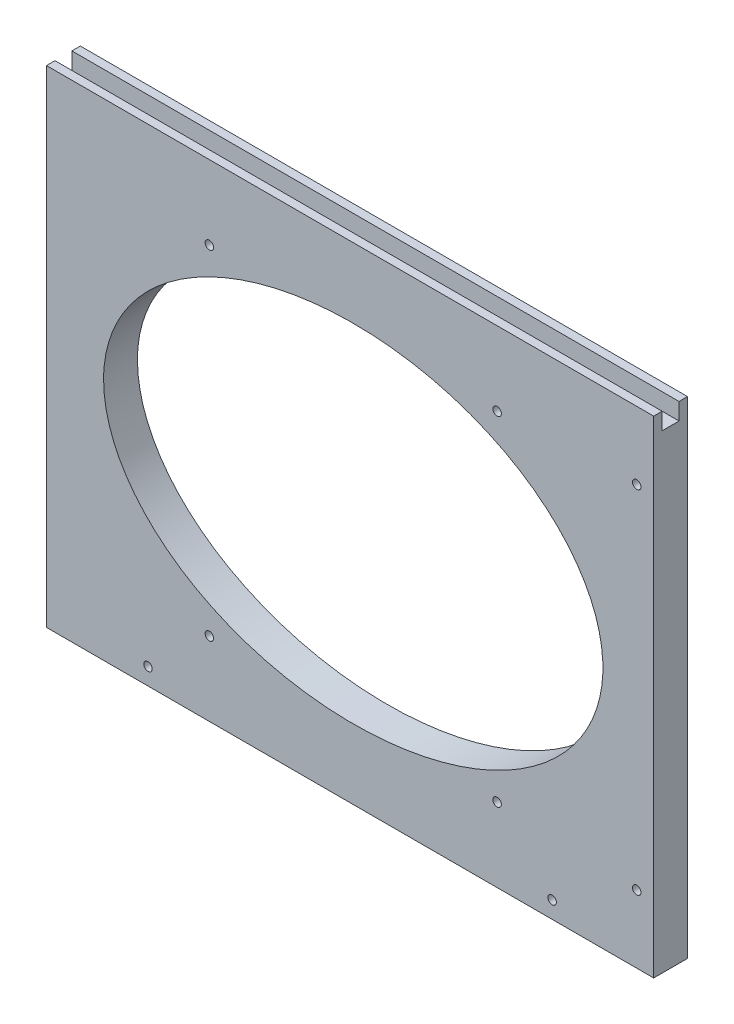
ISO-10303-21;
HEADER;
FILE_DESCRIPTION(('STEP AP214'),'2;1');
FILE_NAME('part.step','',(''),(''),'','','');
FILE_SCHEMA(('AUTOMOTIVE_DESIGN { 1 0 10303 214 1 1 1 1 }'));
ENDSEC;
DATA;
#1=APPLICATION_CONTEXT('core data for automotive mechanical design processes');
#2=APPLICATION_PROTOCOL_DEFINITION('international standard','automotive_design',2000,#1);
#3=PRODUCT_CONTEXT('',#1,'mechanical');
#4=PRODUCT('Part','Part','',(#3));
#5=PRODUCT_RELATED_PRODUCT_CATEGORY('part','',(#4));
#6=PRODUCT_DEFINITION_FORMATION('','',#4);
#7=PRODUCT_DEFINITION_CONTEXT('part definition',#1,'design');
#8=PRODUCT_DEFINITION('design','',#6,#7);
#9=PRODUCT_DEFINITION_SHAPE('','',#8);
#10=(LENGTH_UNIT() NAMED_UNIT(*) SI_UNIT(.MILLI.,.METRE.));
#11=(NAMED_UNIT(*) PLANE_ANGLE_UNIT() SI_UNIT($,.RADIAN.));
#12=(NAMED_UNIT(*) SI_UNIT($,.STERADIAN.) SOLID_ANGLE_UNIT());
#13=UNCERTAINTY_MEASURE_WITH_UNIT(LENGTH_MEASURE(1.E-05),#10,'distance_accuracy_value','');
#14=(GEOMETRIC_REPRESENTATION_CONTEXT(3) GLOBAL_UNCERTAINTY_ASSIGNED_CONTEXT((#13)) GLOBAL_UNIT_ASSIGNED_CONTEXT((#10,
#11,#12)) REPRESENTATION_CONTEXT('',''));
#15=CARTESIAN_POINT('',(0.,0.,0.));
#16=DIRECTION('',(0.,0.,1.));
#17=DIRECTION('',(1.,0.,0.));
#18=AXIS2_PLACEMENT_3D('',#15,#16,#17);
#19=CARTESIAN_POINT('',(-5512.59375,1181.1,-12.7));
#20=DIRECTION('',(0.,1.,0.));
#21=DIRECTION('',(0.,0.,1.));
#22=AXIS2_PLACEMENT_3D('',#19,#20,#21);
#23=PLANE('',#22);
#24=DIRECTION('',(1.,0.,0.));
#25=VECTOR('',#24,1.);
#26=CARTESIAN_POINT('',(-5749.38025612107,1181.1,-3.175));
#27=LINE('',#26,#25);
#28=CARTESIAN_POINT('',(-5740.4,1181.1,-3.175));
#29=VERTEX_POINT('',#28);
#30=CARTESIAN_POINT('',(-5512.59375,1181.1,-3.175));
#31=VERTEX_POINT('',#30);
#32=EDGE_CURVE('E109',#29,#31,#27,.T.);
#33=ORIENTED_EDGE('',*,*,#32,.F.);
#34=DIRECTION('',(0.,0.,1.));
#35=VECTOR('',#34,1.);
#36=CARTESIAN_POINT('',(-5740.4,1181.1,-12.7));
#37=LINE('',#36,#35);
#38=CARTESIAN_POINT('',(-5740.4,1181.1,0.));
#39=VERTEX_POINT('',#38);
#40=EDGE_CURVE('E118',#29,#39,#37,.T.);
#41=ORIENTED_EDGE('',*,*,#40,.T.);
#42=DIRECTION('',(-1.,0.,0.));
#43=VECTOR('',#42,1.);
#44=CARTESIAN_POINT('',(-5512.59375,1181.1,0.));
#45=LINE('',#44,#43);
#46=CARTESIAN_POINT('',(-5512.59375,1181.1,0.));
#47=VERTEX_POINT('',#46);
#48=EDGE_CURVE('E132',#47,#39,#45,.T.);
#49=ORIENTED_EDGE('',*,*,#48,.F.);
#50=DIRECTION('',(0.,0.,1.));
#51=VECTOR('',#50,1.);
#52=CARTESIAN_POINT('',(-5512.59375,1181.1,-12.7));
#53=LINE('',#52,#51);
#54=EDGE_CURVE('E120',#31,#47,#53,.T.);
#55=ORIENTED_EDGE('',*,*,#54,.F.);
#56=EDGE_LOOP('',(#33,#41,#49,#55));
#57=FACE_BOUND('',#56,.T.);
#58=ADVANCED_FACE('F31',(#57),#23,.T.);
#59=CARTESIAN_POINT('',(-5740.4,998.5375,-12.7));
#60=DIRECTION('',(0.,-1.,0.));
#61=DIRECTION('',(0.,0.,-1.));
#62=AXIS2_PLACEMENT_3D('',#59,#60,#61);
#63=PLANE('',#62);
#64=DIRECTION('',(1.,0.,0.));
#65=VECTOR('',#64,1.);
#66=CARTESIAN_POINT('',(-5740.4,998.5375,0.));
#67=LINE('',#66,#65);
#68=CARTESIAN_POINT('',(-5740.4,998.5375,0.));
#69=VERTEX_POINT('',#68);
#70=CARTESIAN_POINT('',(-5512.59375,998.5375,0.));
#71=VERTEX_POINT('',#70);
#72=EDGE_CURVE('E137',#69,#71,#67,.T.);
#73=ORIENTED_EDGE('',*,*,#72,.F.);
#74=DIRECTION('',(0.,0.,1.));
#75=VECTOR('',#74,1.);
#76=CARTESIAN_POINT('',(-5740.4,998.5375,-12.7));
#77=LINE('',#76,#75);
#78=CARTESIAN_POINT('',(-5740.4,998.5375,-12.7));
#79=VERTEX_POINT('',#78);
#80=EDGE_CURVE('E11',#79,#69,#77,.T.);
#81=ORIENTED_EDGE('',*,*,#80,.F.);
#82=DIRECTION('',(1.,0.,0.));
#83=VECTOR('',#82,1.);
#84=CARTESIAN_POINT('',(-5740.4,998.5375,-12.7));
#85=LINE('',#84,#83);
#86=CARTESIAN_POINT('',(-5512.59375,998.5375,-12.7));
#87=VERTEX_POINT('',#86);
#88=EDGE_CURVE('E131',#79,#87,#85,.T.);
#89=ORIENTED_EDGE('',*,*,#88,.T.);
#90=DIRECTION('',(0.,0.,1.));
#91=VECTOR('',#90,1.);
#92=CARTESIAN_POINT('',(-5512.59375,998.5375,-12.7));
#93=LINE('',#92,#91);
#94=EDGE_CURVE('E35',#87,#71,#93,.T.);
#95=ORIENTED_EDGE('',*,*,#94,.T.);
#96=EDGE_LOOP('',(#73,#81,#89,#95));
#97=FACE_BOUND('',#96,.T.);
#98=ADVANCED_FACE('F33',(#97),#63,.T.);
#99=CARTESIAN_POINT('',(-5740.4,1181.1,-12.7));
#100=DIRECTION('',(-1.,0.,0.));
#101=DIRECTION('',(0.,0.,1.));
#102=AXIS2_PLACEMENT_3D('',#99,#100,#101);
#103=PLANE('',#102);
#104=DIRECTION('',(0.,-1.,0.));
#105=VECTOR('',#104,1.);
#106=CARTESIAN_POINT('',(-5740.4,1181.1,-3.175));
#107=LINE('',#106,#105);
#108=CARTESIAN_POINT('',(-5740.4,1174.75,-3.175));
#109=VERTEX_POINT('',#108);
#110=EDGE_CURVE('E105',#29,#109,#107,.T.);
#111=ORIENTED_EDGE('',*,*,#110,.T.);
#112=DIRECTION('',(0.,0.,-1.));
#113=VECTOR('',#112,1.);
#114=CARTESIAN_POINT('',(-5740.4,1174.75,-3.175));
#115=LINE('',#114,#113);
#116=CARTESIAN_POINT('',(-5740.4,1174.75,-9.525));
#117=VERTEX_POINT('',#116);
#118=EDGE_CURVE('E202',#109,#117,#115,.T.);
#119=ORIENTED_EDGE('',*,*,#118,.T.);
#120=DIRECTION('',(0.,1.,0.));
#121=VECTOR('',#120,1.);
#122=CARTESIAN_POINT('',(-5740.4,1174.75,-9.525));
#123=LINE('',#122,#121);
#124=CARTESIAN_POINT('',(-5740.4,1181.1,-9.525));
#125=VERTEX_POINT('',#124);
#126=EDGE_CURVE('E197',#117,#125,#123,.T.);
#127=ORIENTED_EDGE('',*,*,#126,.T.);
#128=CARTESIAN_POINT('',(-5740.4,1181.1,-12.7));
#129=VERTEX_POINT('',#128);
#130=EDGE_CURVE('E40',#129,#125,#37,.T.);
#131=ORIENTED_EDGE('',*,*,#130,.F.);
#132=DIRECTION('',(0.,-1.,0.));
#133=VECTOR('',#132,1.);
#134=CARTESIAN_POINT('',(-5740.4,1181.1,-12.7));
#135=LINE('',#134,#133);
#136=EDGE_CURVE('E141',#129,#79,#135,.T.);
#137=ORIENTED_EDGE('',*,*,#136,.T.);
#138=ORIENTED_EDGE('',*,*,#80,.T.);
#139=DIRECTION('',(0.,-1.,0.));
#140=VECTOR('',#139,1.);
#141=CARTESIAN_POINT('',(-5740.4,1181.1,0.));
#142=LINE('',#141,#140);
#143=EDGE_CURVE('E124',#39,#69,#142,.T.);
#144=ORIENTED_EDGE('',*,*,#143,.F.);
#145=ORIENTED_EDGE('',*,*,#40,.F.);
#146=EDGE_LOOP('',(#111,#119,#127,#131,#137,#138,#144,#145));
#147=FACE_BOUND('',#146,.T.);
#148=ADVANCED_FACE('F122',(#147),#103,.T.);
#149=DIRECTION('',(1.,0.,0.));
#150=VECTOR('',#149,1.);
#151=CARTESIAN_POINT('',(-5749.38025612107,1181.1,-9.525));
#152=LINE('',#151,#150);
#153=CARTESIAN_POINT('',(-5512.59375,1181.1,-9.525));
#154=VERTEX_POINT('',#153);
#155=EDGE_CURVE('E200',#125,#154,#152,.T.);
#156=ORIENTED_EDGE('',*,*,#155,.T.);
#157=CARTESIAN_POINT('',(-5512.59375,1181.1,-12.7));
#158=VERTEX_POINT('',#157);
#159=EDGE_CURVE('E125',#158,#154,#53,.T.);
#160=ORIENTED_EDGE('',*,*,#159,.F.);
#161=DIRECTION('',(-1.,0.,0.));
#162=VECTOR('',#161,1.);
#163=CARTESIAN_POINT('',(-5512.59375,1181.1,-12.7));
#164=LINE('',#163,#162);
#165=EDGE_CURVE('E143',#158,#129,#164,.T.);
#166=ORIENTED_EDGE('',*,*,#165,.T.);
#167=ORIENTED_EDGE('',*,*,#130,.T.);
#168=EDGE_LOOP('',(#156,#160,#166,#167));
#169=FACE_BOUND('',#168,.T.);
#170=ADVANCED_FACE('F177',(#169),#23,.T.);
#171=CARTESIAN_POINT('',(-5512.59375,998.5375,-12.7));
#172=DIRECTION('',(1.,0.,0.));
#173=DIRECTION('',(0.,0.,-1.));
#174=AXIS2_PLACEMENT_3D('',#171,#172,#173);
#175=PLANE('',#174);
#176=DIRECTION('',(0.,-1.,0.));
#177=VECTOR('',#176,1.);
#178=CARTESIAN_POINT('',(-5512.59375,1181.1,-3.175));
#179=LINE('',#178,#177);
#180=CARTESIAN_POINT('',(-5512.59375,1174.75,-3.175));
#181=VERTEX_POINT('',#180);
#182=EDGE_CURVE('E190',#31,#181,#179,.T.);
#183=ORIENTED_EDGE('',*,*,#182,.F.);
#184=ORIENTED_EDGE('',*,*,#54,.T.);
#185=DIRECTION('',(0.,1.,0.));
#186=VECTOR('',#185,1.);
#187=CARTESIAN_POINT('',(-5512.59375,998.5375,0.));
#188=LINE('',#187,#186);
#189=EDGE_CURVE('E134',#71,#47,#188,.T.);
#190=ORIENTED_EDGE('',*,*,#189,.F.);
#191=ORIENTED_EDGE('',*,*,#94,.F.);
#192=DIRECTION('',(0.,1.,0.));
#193=VECTOR('',#192,1.);
#194=CARTESIAN_POINT('',(-5512.59375,998.5375,-12.7));
#195=LINE('',#194,#193);
#196=EDGE_CURVE('E146',#87,#158,#195,.T.);
#197=ORIENTED_EDGE('',*,*,#196,.T.);
#198=ORIENTED_EDGE('',*,*,#159,.T.);
#199=DIRECTION('',(0.,1.,0.));
#200=VECTOR('',#199,1.);
#201=CARTESIAN_POINT('',(-5512.59375,1174.75,-9.525));
#202=LINE('',#201,#200);
#203=CARTESIAN_POINT('',(-5512.59375,1174.75,-9.525));
#204=VERTEX_POINT('',#203);
#205=EDGE_CURVE('E192',#204,#154,#202,.T.);
#206=ORIENTED_EDGE('',*,*,#205,.F.);
#207=DIRECTION('',(0.,0.,-1.));
#208=VECTOR('',#207,1.);
#209=CARTESIAN_POINT('',(-5512.59375,1174.75,-3.175));
#210=LINE('',#209,#208);
#211=EDGE_CURVE('E48',#181,#204,#210,.T.);
#212=ORIENTED_EDGE('',*,*,#211,.F.);
#213=EDGE_LOOP('',(#183,#184,#190,#191,#197,#198,#206,#212));
#214=FACE_BOUND('',#213,.T.);
#215=ADVANCED_FACE('F170',(#214),#175,.T.);
#216=CARTESIAN_POINT('',(-5512.59375,998.5375,-12.7));
#217=DIRECTION('',(0.,0.,1.));
#218=DIRECTION('',(1.,0.,0.));
#219=AXIS2_PLACEMENT_3D('',#216,#217,#218);
#220=PLANE('',#219);
#221=CARTESIAN_POINT('',(-5679.28125,1153.31875,-12.7));
#222=DIRECTION('',(0.,0.,1.));
#223=DIRECTION('',(1.,0.,0.));
#224=AXIS2_PLACEMENT_3D('',#221,#222,#223);
#225=CIRCLE('',#224,1.58750000000051);
#226=CARTESIAN_POINT('',(-5677.69375,1153.31875,-12.7));
#227=VERTEX_POINT('',#226);
#228=EDGE_CURVE('E211',#227,#227,#225,.F.);
#229=ORIENTED_EDGE('',*,*,#228,.F.);
#230=EDGE_LOOP('',(#229));
#231=FACE_BOUND('',#230,.T.);
#232=CARTESIAN_POINT('',(-5702.3,1004.8875,-12.7));
#233=DIRECTION('',(0.,0.,1.));
#234=DIRECTION('',(1.,0.,0.));
#235=AXIS2_PLACEMENT_3D('',#232,#233,#234);
#236=CIRCLE('',#235,1.58750000000051);
#237=CARTESIAN_POINT('',(-5700.7125,1004.8875,-12.7));
#238=VERTEX_POINT('',#237);
#239=EDGE_CURVE('E217',#238,#238,#236,.F.);
#240=ORIENTED_EDGE('',*,*,#239,.F.);
#241=EDGE_LOOP('',(#240));
#242=FACE_BOUND('',#241,.T.);
#243=CARTESIAN_POINT('',(-5679.28125,1026.31875,-12.7));
#244=DIRECTION('',(0.,0.,1.));
#245=DIRECTION('',(1.,0.,0.));
#246=AXIS2_PLACEMENT_3D('',#243,#244,#245);
#247=CIRCLE('',#246,1.58750000000045);
#248=CARTESIAN_POINT('',(-5677.69375,1026.31875,-12.7));
#249=VERTEX_POINT('',#248);
#250=EDGE_CURVE('E223',#249,#249,#247,.F.);
#251=ORIENTED_EDGE('',*,*,#250,.F.);
#252=EDGE_LOOP('',(#251));
#253=FACE_BOUND('',#252,.T.);
#254=CARTESIAN_POINT('',(-5571.33125,1026.31875,-12.7));
#255=DIRECTION('',(0.,0.,1.));
#256=DIRECTION('',(1.,0.,0.));
#257=AXIS2_PLACEMENT_3D('',#254,#255,#256);
#258=CIRCLE('',#257,1.58750000000045);
#259=CARTESIAN_POINT('',(-5569.74375,1026.31875,-12.7));
#260=VERTEX_POINT('',#259);
#261=EDGE_CURVE('E229',#260,#260,#258,.F.);
#262=ORIENTED_EDGE('',*,*,#261,.F.);
#263=EDGE_LOOP('',(#262));
#264=FACE_BOUND('',#263,.T.);
#265=CARTESIAN_POINT('',(-5550.69375,1004.8875,-12.7));
#266=DIRECTION('',(0.,0.,1.));
#267=DIRECTION('',(1.,0.,0.));
#268=AXIS2_PLACEMENT_3D('',#265,#266,#267);
#269=CIRCLE('',#268,1.58750000000051);
#270=CARTESIAN_POINT('',(-5549.10625,1004.8875,-12.7));
#271=VERTEX_POINT('',#270);
#272=EDGE_CURVE('E235',#271,#271,#269,.F.);
#273=ORIENTED_EDGE('',*,*,#272,.F.);
#274=EDGE_LOOP('',(#273));
#275=FACE_BOUND('',#274,.T.);
#276=CARTESIAN_POINT('',(-5518.94375,1023.9375,-12.7));
#277=DIRECTION('',(0.,0.,1.));
#278=DIRECTION('',(1.,0.,0.));
#279=AXIS2_PLACEMENT_3D('',#276,#277,#278);
#280=CIRCLE('',#279,1.58750000000051);
#281=CARTESIAN_POINT('',(-5517.35625,1023.9375,-12.7));
#282=VERTEX_POINT('',#281);
#283=EDGE_CURVE('E241',#282,#282,#280,.F.);
#284=ORIENTED_EDGE('',*,*,#283,.F.);
#285=EDGE_LOOP('',(#284));
#286=FACE_BOUND('',#285,.T.);
#287=CARTESIAN_POINT('',(-5518.94375,1155.7,-12.7));
#288=DIRECTION('',(0.,0.,1.));
#289=DIRECTION('',(1.,0.,0.));
#290=AXIS2_PLACEMENT_3D('',#287,#288,#289);
#291=CIRCLE('',#290,1.58750000000051);
#292=CARTESIAN_POINT('',(-5517.35625,1155.7,-12.7));
#293=VERTEX_POINT('',#292);
#294=EDGE_CURVE('E247',#293,#293,#291,.F.);
#295=ORIENTED_EDGE('',*,*,#294,.F.);
#296=EDGE_LOOP('',(#295));
#297=FACE_BOUND('',#296,.T.);
#298=CARTESIAN_POINT('',(-5571.33125,1153.31875,-12.7));
#299=DIRECTION('',(0.,0.,1.));
#300=DIRECTION('',(1.,0.,0.));
#301=AXIS2_PLACEMENT_3D('',#298,#299,#300);
#302=CIRCLE('',#301,1.58750000000045);
#303=CARTESIAN_POINT('',(-5569.74375,1153.31875,-12.7));
#304=VERTEX_POINT('',#303);
#305=EDGE_CURVE('E154',#304,#304,#302,.F.);
#306=ORIENTED_EDGE('',*,*,#305,.F.);
#307=EDGE_LOOP('',(#306));
#308=FACE_BOUND('',#307,.T.);
#309=CARTESIAN_POINT('',(-5625.30625,1089.81875,-12.7));
#310=DIRECTION('',(0.,0.,1.));
#311=DIRECTION('',(-1.,0.,0.));
#312=AXIS2_PLACEMENT_3D('',#309,#310,#311);
#313=ELLIPSE('',#312,93.6624999999998,65.0874999965074);
#314=CARTESIAN_POINT('',(-5718.96875,1089.81875,-12.7));
#315=VERTEX_POINT('',#314);
#316=EDGE_CURVE('E140',#315,#315,#313,.F.);
#317=ORIENTED_EDGE('',*,*,#316,.F.);
#318=EDGE_LOOP('',(#317));
#319=FACE_BOUND('',#318,.T.);
#320=ORIENTED_EDGE('',*,*,#88,.F.);
#321=ORIENTED_EDGE('',*,*,#136,.F.);
#322=ORIENTED_EDGE('',*,*,#165,.F.);
#323=ORIENTED_EDGE('',*,*,#196,.F.);
#324=EDGE_LOOP('',(#320,#321,#322,#323));
#325=FACE_BOUND('',#324,.T.);
#326=ADVANCED_FACE('F167',(#231,#242,#253,#264,#275,#286,#297,#308,#319,#325),#220,.F.);
#327=CARTESIAN_POINT('',(-5512.59375,998.5375,0.));
#328=DIRECTION('',(0.,0.,1.));
#329=DIRECTION('',(1.,0.,0.));
#330=AXIS2_PLACEMENT_3D('',#327,#328,#329);
#331=PLANE('',#330);
#332=CARTESIAN_POINT('',(-5679.28125,1153.31875,0.));
#333=DIRECTION('',(0.,0.,1.));
#334=DIRECTION('',(1.,0.,0.));
#335=AXIS2_PLACEMENT_3D('',#332,#333,#334);
#336=CIRCLE('',#335,1.58750000000051);
#337=CARTESIAN_POINT('',(-5677.69375,1153.31875,0.));
#338=VERTEX_POINT('',#337);
#339=EDGE_CURVE('E206',#338,#338,#336,.T.);
#340=ORIENTED_EDGE('',*,*,#339,.F.);
#341=EDGE_LOOP('',(#340));
#342=FACE_BOUND('',#341,.T.);
#343=CARTESIAN_POINT('',(-5702.3,1004.8875,0.));
#344=DIRECTION('',(0.,0.,1.));
#345=DIRECTION('',(1.,0.,0.));
#346=AXIS2_PLACEMENT_3D('',#343,#344,#345);
#347=CIRCLE('',#346,1.58750000000051);
#348=CARTESIAN_POINT('',(-5700.7125,1004.8875,0.));
#349=VERTEX_POINT('',#348);
#350=EDGE_CURVE('E214',#349,#349,#347,.T.);
#351=ORIENTED_EDGE('',*,*,#350,.F.);
#352=EDGE_LOOP('',(#351));
#353=FACE_BOUND('',#352,.T.);
#354=CARTESIAN_POINT('',(-5679.28125,1026.31875,0.));
#355=DIRECTION('',(0.,0.,1.));
#356=DIRECTION('',(1.,0.,0.));
#357=AXIS2_PLACEMENT_3D('',#354,#355,#356);
#358=CIRCLE('',#357,1.58750000000045);
#359=CARTESIAN_POINT('',(-5677.69375,1026.31875,0.));
#360=VERTEX_POINT('',#359);
#361=EDGE_CURVE('E220',#360,#360,#358,.T.);
#362=ORIENTED_EDGE('',*,*,#361,.F.);
#363=EDGE_LOOP('',(#362));
#364=FACE_BOUND('',#363,.T.);
#365=CARTESIAN_POINT('',(-5571.33125,1026.31875,0.));
#366=DIRECTION('',(0.,0.,1.));
#367=DIRECTION('',(1.,0.,0.));
#368=AXIS2_PLACEMENT_3D('',#365,#366,#367);
#369=CIRCLE('',#368,1.58750000000045);
#370=CARTESIAN_POINT('',(-5569.74375,1026.31875,0.));
#371=VERTEX_POINT('',#370);
#372=EDGE_CURVE('E226',#371,#371,#369,.T.);
#373=ORIENTED_EDGE('',*,*,#372,.F.);
#374=EDGE_LOOP('',(#373));
#375=FACE_BOUND('',#374,.T.);
#376=CARTESIAN_POINT('',(-5550.69375,1004.8875,0.));
#377=DIRECTION('',(0.,0.,1.));
#378=DIRECTION('',(1.,0.,0.));
#379=AXIS2_PLACEMENT_3D('',#376,#377,#378);
#380=CIRCLE('',#379,1.58750000000051);
#381=CARTESIAN_POINT('',(-5549.10625,1004.8875,0.));
#382=VERTEX_POINT('',#381);
#383=EDGE_CURVE('E232',#382,#382,#380,.T.);
#384=ORIENTED_EDGE('',*,*,#383,.F.);
#385=EDGE_LOOP('',(#384));
#386=FACE_BOUND('',#385,.T.);
#387=CARTESIAN_POINT('',(-5518.94375,1023.9375,0.));
#388=DIRECTION('',(0.,0.,1.));
#389=DIRECTION('',(1.,0.,0.));
#390=AXIS2_PLACEMENT_3D('',#387,#388,#389);
#391=CIRCLE('',#390,1.58750000000051);
#392=CARTESIAN_POINT('',(-5517.35625,1023.9375,0.));
#393=VERTEX_POINT('',#392);
#394=EDGE_CURVE('E238',#393,#393,#391,.T.);
#395=ORIENTED_EDGE('',*,*,#394,.F.);
#396=EDGE_LOOP('',(#395));
#397=FACE_BOUND('',#396,.T.);
#398=CARTESIAN_POINT('',(-5518.94375,1155.7,0.));
#399=DIRECTION('',(0.,0.,1.));
#400=DIRECTION('',(1.,0.,0.));
#401=AXIS2_PLACEMENT_3D('',#398,#399,#400);
#402=CIRCLE('',#401,1.58750000000051);
#403=CARTESIAN_POINT('',(-5517.35625,1155.7,0.));
#404=VERTEX_POINT('',#403);
#405=EDGE_CURVE('E244',#404,#404,#402,.T.);
#406=ORIENTED_EDGE('',*,*,#405,.F.);
#407=EDGE_LOOP('',(#406));
#408=FACE_BOUND('',#407,.T.);
#409=CARTESIAN_POINT('',(-5571.33125,1153.31875,0.));
#410=DIRECTION('',(0.,0.,1.));
#411=DIRECTION('',(1.,0.,0.));
#412=AXIS2_PLACEMENT_3D('',#409,#410,#411);
#413=CIRCLE('',#412,1.58750000000045);
#414=CARTESIAN_POINT('',(-5569.74375,1153.31875,0.));
#415=VERTEX_POINT('',#414);
#416=EDGE_CURVE('E249',#415,#415,#413,.T.);
#417=ORIENTED_EDGE('',*,*,#416,.F.);
#418=EDGE_LOOP('',(#417));
#419=FACE_BOUND('',#418,.T.);
#420=CARTESIAN_POINT('',(-5625.30625,1089.81875,0.));
#421=DIRECTION('',(0.,0.,1.));
#422=DIRECTION('',(-1.,0.,0.));
#423=AXIS2_PLACEMENT_3D('',#420,#421,#422);
#424=ELLIPSE('',#423,93.6624999999998,65.0874999965074);
#425=CARTESIAN_POINT('',(-5718.96875,1089.81875,0.));
#426=VERTEX_POINT('',#425);
#427=EDGE_CURVE('E151',#426,#426,#424,.T.);
#428=ORIENTED_EDGE('',*,*,#427,.F.);
#429=EDGE_LOOP('',(#428));
#430=FACE_BOUND('',#429,.T.);
#431=ORIENTED_EDGE('',*,*,#72,.T.);
#432=ORIENTED_EDGE('',*,*,#189,.T.);
#433=ORIENTED_EDGE('',*,*,#48,.T.);
#434=ORIENTED_EDGE('',*,*,#143,.T.);
#435=EDGE_LOOP('',(#431,#432,#433,#434));
#436=FACE_BOUND('',#435,.T.);
#437=ADVANCED_FACE('F164',(#342,#353,#364,#375,#386,#397,#408,#419,#430,#436),#331,.T.);
#438=CARTESIAN_POINT('',(-5625.30625,1089.81875,-240.814414818926));
#439=DIRECTION('',(0.,0.,1.));
#440=DIRECTION('',(-1.,0.,0.));
#441=AXIS2_PLACEMENT_3D('',#438,#439,#440);
#442=ELLIPSE('',#441,93.6624999999998,65.0874999965074);
#443=DIRECTION('',(0.,0.,1.));
#444=VECTOR('',#443,1.);
#445=SURFACE_OF_LINEAR_EXTRUSION('',#442,#444);
#446=ORIENTED_EDGE('',*,*,#316,.T.);
#447=EDGE_LOOP('',(#446));
#448=FACE_BOUND('',#447,.T.);
#449=ORIENTED_EDGE('',*,*,#427,.T.);
#450=EDGE_LOOP('',(#449));
#451=FACE_BOUND('',#450,.T.);
#452=ADVANCED_FACE('F159',(#448,#451),#445,.F.);
#453=CARTESIAN_POINT('',(-5571.33125,1153.31875,-240.814414818926));
#454=DIRECTION('',(0.,0.,1.));
#455=DIRECTION('',(1.,0.,0.));
#456=AXIS2_PLACEMENT_3D('',#453,#454,#455);
#457=CYLINDRICAL_SURFACE('',#456,1.58750000000045);
#458=ORIENTED_EDGE('',*,*,#305,.T.);
#459=EDGE_LOOP('',(#458));
#460=FACE_BOUND('',#459,.T.);
#461=ORIENTED_EDGE('',*,*,#416,.T.);
#462=EDGE_LOOP('',(#461));
#463=FACE_BOUND('',#462,.T.);
#464=ADVANCED_FACE('F163',(#460,#463),#457,.F.);
#465=CARTESIAN_POINT('',(-5518.94375,1155.7,-240.814414818926));
#466=DIRECTION('',(0.,0.,1.));
#467=DIRECTION('',(1.,0.,0.));
#468=AXIS2_PLACEMENT_3D('',#465,#466,#467);
#469=CYLINDRICAL_SURFACE('',#468,1.58750000000051);
#470=ORIENTED_EDGE('',*,*,#294,.T.);
#471=EDGE_LOOP('',(#470));
#472=FACE_BOUND('',#471,.T.);
#473=ORIENTED_EDGE('',*,*,#405,.T.);
#474=EDGE_LOOP('',(#473));
#475=FACE_BOUND('',#474,.T.);
#476=ADVANCED_FACE('F296',(#472,#475),#469,.F.);
#477=CARTESIAN_POINT('',(-5518.94375,1023.9375,-240.814414818926));
#478=DIRECTION('',(0.,0.,1.));
#479=DIRECTION('',(1.,0.,0.));
#480=AXIS2_PLACEMENT_3D('',#477,#478,#479);
#481=CYLINDRICAL_SURFACE('',#480,1.58750000000051);
#482=ORIENTED_EDGE('',*,*,#283,.T.);
#483=EDGE_LOOP('',(#482));
#484=FACE_BOUND('',#483,.T.);
#485=ORIENTED_EDGE('',*,*,#394,.T.);
#486=EDGE_LOOP('',(#485));
#487=FACE_BOUND('',#486,.T.);
#488=ADVANCED_FACE('F293',(#484,#487),#481,.F.);
#489=CARTESIAN_POINT('',(-5550.69375,1004.8875,-240.814414818926));
#490=DIRECTION('',(0.,0.,1.));
#491=DIRECTION('',(1.,0.,0.));
#492=AXIS2_PLACEMENT_3D('',#489,#490,#491);
#493=CYLINDRICAL_SURFACE('',#492,1.58750000000051);
#494=ORIENTED_EDGE('',*,*,#272,.T.);
#495=EDGE_LOOP('',(#494));
#496=FACE_BOUND('',#495,.T.);
#497=ORIENTED_EDGE('',*,*,#383,.T.);
#498=EDGE_LOOP('',(#497));
#499=FACE_BOUND('',#498,.T.);
#500=ADVANCED_FACE('F289',(#496,#499),#493,.F.);
#501=CARTESIAN_POINT('',(-5571.33125,1026.31875,-240.814414818926));
#502=DIRECTION('',(0.,0.,1.));
#503=DIRECTION('',(1.,0.,0.));
#504=AXIS2_PLACEMENT_3D('',#501,#502,#503);
#505=CYLINDRICAL_SURFACE('',#504,1.58750000000045);
#506=ORIENTED_EDGE('',*,*,#261,.T.);
#507=EDGE_LOOP('',(#506));
#508=FACE_BOUND('',#507,.T.);
#509=ORIENTED_EDGE('',*,*,#372,.T.);
#510=EDGE_LOOP('',(#509));
#511=FACE_BOUND('',#510,.T.);
#512=ADVANCED_FACE('F285',(#508,#511),#505,.F.);
#513=CARTESIAN_POINT('',(-5679.28125,1026.31875,-240.814414818926));
#514=DIRECTION('',(0.,0.,1.));
#515=DIRECTION('',(1.,0.,0.));
#516=AXIS2_PLACEMENT_3D('',#513,#514,#515);
#517=CYLINDRICAL_SURFACE('',#516,1.58750000000045);
#518=ORIENTED_EDGE('',*,*,#250,.T.);
#519=EDGE_LOOP('',(#518));
#520=FACE_BOUND('',#519,.T.);
#521=ORIENTED_EDGE('',*,*,#361,.T.);
#522=EDGE_LOOP('',(#521));
#523=FACE_BOUND('',#522,.T.);
#524=ADVANCED_FACE('F281',(#520,#523),#517,.F.);
#525=CARTESIAN_POINT('',(-5702.3,1004.8875,-240.814414818926));
#526=DIRECTION('',(0.,0.,1.));
#527=DIRECTION('',(1.,0.,0.));
#528=AXIS2_PLACEMENT_3D('',#525,#526,#527);
#529=CYLINDRICAL_SURFACE('',#528,1.58750000000051);
#530=ORIENTED_EDGE('',*,*,#239,.T.);
#531=EDGE_LOOP('',(#530));
#532=FACE_BOUND('',#531,.T.);
#533=ORIENTED_EDGE('',*,*,#350,.T.);
#534=EDGE_LOOP('',(#533));
#535=FACE_BOUND('',#534,.T.);
#536=ADVANCED_FACE('F277',(#532,#535),#529,.F.);
#537=CARTESIAN_POINT('',(-5679.28125,1153.31875,-240.814414818926));
#538=DIRECTION('',(0.,0.,1.));
#539=DIRECTION('',(1.,0.,0.));
#540=AXIS2_PLACEMENT_3D('',#537,#538,#539);
#541=CYLINDRICAL_SURFACE('',#540,1.58750000000051);
#542=ORIENTED_EDGE('',*,*,#228,.T.);
#543=EDGE_LOOP('',(#542));
#544=FACE_BOUND('',#543,.T.);
#545=ORIENTED_EDGE('',*,*,#339,.T.);
#546=EDGE_LOOP('',(#545));
#547=FACE_BOUND('',#546,.T.);
#548=ADVANCED_FACE('F272',(#544,#547),#541,.F.);
#549=CARTESIAN_POINT('',(-5749.38025612107,1181.1,-3.175));
#550=DIRECTION('',(0.,0.,1.));
#551=DIRECTION('',(0.,-1.,0.));
#552=AXIS2_PLACEMENT_3D('',#549,#550,#551);
#553=PLANE('',#552);
#554=ORIENTED_EDGE('',*,*,#32,.T.);
#555=ORIENTED_EDGE('',*,*,#182,.T.);
#556=DIRECTION('',(1.,0.,0.));
#557=VECTOR('',#556,1.);
#558=CARTESIAN_POINT('',(-5749.38025612107,1174.75,-3.175));
#559=LINE('',#558,#557);
#560=EDGE_CURVE('E111',#109,#181,#559,.T.);
#561=ORIENTED_EDGE('',*,*,#560,.F.);
#562=ORIENTED_EDGE('',*,*,#110,.F.);
#563=EDGE_LOOP('',(#554,#555,#561,#562));
#564=FACE_BOUND('',#563,.T.);
#565=ADVANCED_FACE('F107',(#564),#553,.F.);
#566=CARTESIAN_POINT('',(-5749.38025612107,1174.75,-3.175));
#567=DIRECTION('',(0.,-1.,0.));
#568=DIRECTION('',(0.,0.,-1.));
#569=AXIS2_PLACEMENT_3D('',#566,#567,#568);
#570=PLANE('',#569);
#571=ORIENTED_EDGE('',*,*,#560,.T.);
#572=ORIENTED_EDGE('',*,*,#211,.T.);
#573=DIRECTION('',(1.,0.,0.));
#574=VECTOR('',#573,1.);
#575=CARTESIAN_POINT('',(-5749.38025612107,1174.75,-9.525));
#576=LINE('',#575,#574);
#577=EDGE_CURVE('E201',#117,#204,#576,.T.);
#578=ORIENTED_EDGE('',*,*,#577,.F.);
#579=ORIENTED_EDGE('',*,*,#118,.F.);
#580=EDGE_LOOP('',(#571,#572,#578,#579));
#581=FACE_BOUND('',#580,.T.);
#582=ADVANCED_FACE('F264',(#581),#570,.F.);
#583=CARTESIAN_POINT('',(-5749.38025612107,1174.75,-9.525));
#584=DIRECTION('',(0.,0.,-1.));
#585=DIRECTION('',(-1.,0.,0.));
#586=AXIS2_PLACEMENT_3D('',#583,#584,#585);
#587=PLANE('',#586);
#588=ORIENTED_EDGE('',*,*,#577,.T.);
#589=ORIENTED_EDGE('',*,*,#205,.T.);
#590=ORIENTED_EDGE('',*,*,#155,.F.);
#591=ORIENTED_EDGE('',*,*,#126,.F.);
#592=EDGE_LOOP('',(#588,#589,#590,#591));
#593=FACE_BOUND('',#592,.T.);
#594=ADVANCED_FACE('F263',(#593),#587,.F.);
#595=CLOSED_SHELL('',(#58,#98,#148,#170,#215,#326,#437,#452,#464,#476,#488,#500,#512,#524,#536,
#548,#565,#582,#594));
#596=MANIFOLD_SOLID_BREP('B2',#595);
#597=ADVANCED_BREP_SHAPE_REPRESENTATION('',(#18,#596),#14);
#598=SHAPE_DEFINITION_REPRESENTATION(#9,#597);
ENDSEC;
END-ISO-10303-21;
